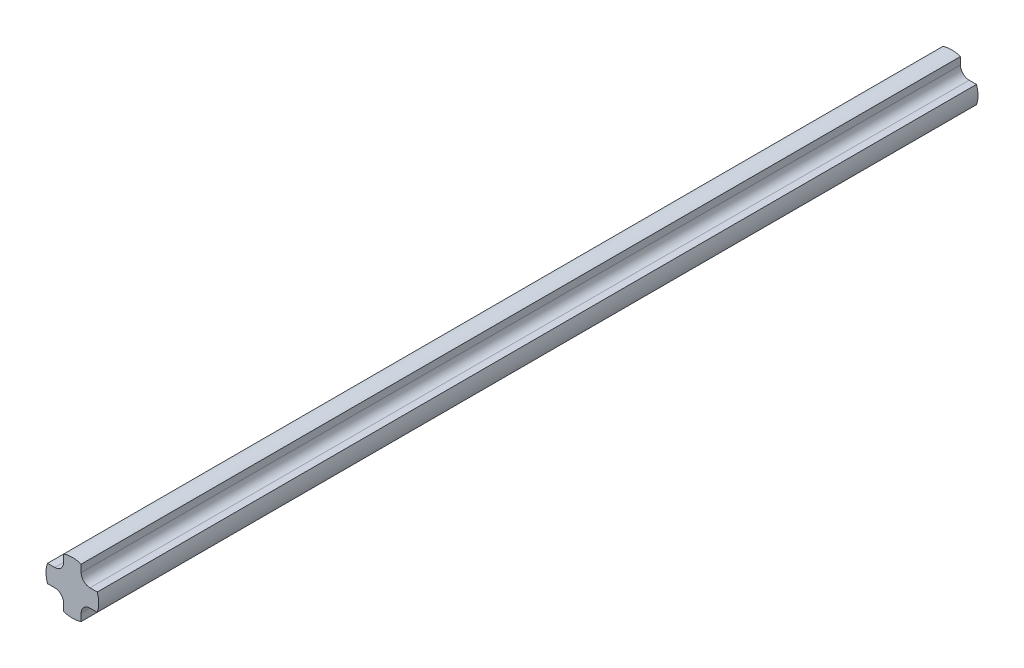
ISO-10303-21;
HEADER;
FILE_DESCRIPTION(('STEP AP214'),'2;1');
FILE_NAME('part.step','',(''),(''),'','','');
FILE_SCHEMA(('AUTOMOTIVE_DESIGN { 1 0 10303 214 1 1 1 1 }'));
ENDSEC;
DATA;
#1=APPLICATION_CONTEXT('core data for automotive mechanical design processes');
#2=APPLICATION_PROTOCOL_DEFINITION('international standard','automotive_design',2000,#1);
#3=PRODUCT_CONTEXT('',#1,'mechanical');
#4=PRODUCT('Part','Part','',(#3));
#5=PRODUCT_RELATED_PRODUCT_CATEGORY('part','',(#4));
#6=PRODUCT_DEFINITION_FORMATION('','',#4);
#7=PRODUCT_DEFINITION_CONTEXT('part definition',#1,'design');
#8=PRODUCT_DEFINITION('design','',#6,#7);
#9=PRODUCT_DEFINITION_SHAPE('','',#8);
#10=(LENGTH_UNIT() NAMED_UNIT(*) SI_UNIT(.MILLI.,.METRE.));
#11=(NAMED_UNIT(*) PLANE_ANGLE_UNIT() SI_UNIT($,.RADIAN.));
#12=(NAMED_UNIT(*) SI_UNIT($,.STERADIAN.) SOLID_ANGLE_UNIT());
#13=UNCERTAINTY_MEASURE_WITH_UNIT(LENGTH_MEASURE(1.E-05),#10,'distance_accuracy_value','');
#14=(GEOMETRIC_REPRESENTATION_CONTEXT(3) GLOBAL_UNCERTAINTY_ASSIGNED_CONTEXT((#13)) GLOBAL_UNIT_ASSIGNED_CONTEXT((#10,
#11,#12)) REPRESENTATION_CONTEXT('',''));
#15=CARTESIAN_POINT('',(0.,0.,0.));
#16=DIRECTION('',(0.,0.,1.));
#17=DIRECTION('',(1.,0.,0.));
#18=AXIS2_PLACEMENT_3D('',#15,#16,#17);
#19=CARTESIAN_POINT('',(-141.42135623731,-50.,5000.));
#20=DIRECTION('',(0.,1.,0.));
#21=DIRECTION('',(0.,0.,1.));
#22=AXIS2_PLACEMENT_3D('',#19,#20,#21);
#23=PLANE('',#22);
#24=DIRECTION('',(1.,0.,0.));
#25=VECTOR('',#24,1.);
#26=CARTESIAN_POINT('',(-141.42135623731,-50.,0.));
#27=LINE('',#26,#25);
#28=CARTESIAN_POINT('',(-141.42135623731,-50.,0.));
#29=VERTEX_POINT('',#28);
#30=CARTESIAN_POINT('',(-99.9999999999996,-50.,0.));
#31=VERTEX_POINT('',#30);
#32=EDGE_CURVE('E245',#29,#31,#27,.T.);
#33=ORIENTED_EDGE('',*,*,#32,.T.);
#34=DIRECTION('',(0.,0.,-1.));
#35=VECTOR('',#34,1.);
#36=CARTESIAN_POINT('',(-99.9999999999996,-50.,5000.));
#37=LINE('',#36,#35);
#38=CARTESIAN_POINT('',(-99.9999999999996,-50.,5000.));
#39=VERTEX_POINT('',#38);
#40=EDGE_CURVE('E64',#31,#39,#37,.F.);
#41=ORIENTED_EDGE('',*,*,#40,.T.);
#42=DIRECTION('',(1.,0.,0.));
#43=VECTOR('',#42,1.);
#44=CARTESIAN_POINT('',(-141.42135623731,-50.,5000.));
#45=LINE('',#44,#43);
#46=CARTESIAN_POINT('',(-141.42135623731,-50.,5000.));
#47=VERTEX_POINT('',#46);
#48=EDGE_CURVE('E237',#47,#39,#45,.T.);
#49=ORIENTED_EDGE('',*,*,#48,.F.);
#50=DIRECTION('',(0.,0.,-1.));
#51=VECTOR('',#50,1.);
#52=CARTESIAN_POINT('',(-141.42135623731,-50.,5000.));
#53=LINE('',#52,#51);
#54=EDGE_CURVE('E251',#47,#29,#53,.T.);
#55=ORIENTED_EDGE('',*,*,#54,.T.);
#56=EDGE_LOOP('',(#33,#41,#49,#55));
#57=FACE_BOUND('',#56,.T.);
#58=ADVANCED_FACE('F43',(#57),#23,.F.);
#59=CARTESIAN_POINT('',(-141.421356237309,50.,5000.));
#60=DIRECTION('',(0.,-1.,0.));
#61=DIRECTION('',(0.,0.,-1.));
#62=AXIS2_PLACEMENT_3D('',#59,#60,#61);
#63=PLANE('',#62);
#64=DIRECTION('',(-1.,0.,0.));
#65=VECTOR('',#64,1.);
#66=CARTESIAN_POINT('',(-141.421356237309,50.,5000.));
#67=LINE('',#66,#65);
#68=CARTESIAN_POINT('',(-100.,50.,5000.));
#69=VERTEX_POINT('',#68);
#70=CARTESIAN_POINT('',(-141.421356237309,50.,5000.));
#71=VERTEX_POINT('',#70);
#72=EDGE_CURVE('E240',#69,#71,#67,.T.);
#73=ORIENTED_EDGE('',*,*,#72,.F.);
#74=DIRECTION('',(0.,0.,1.));
#75=VECTOR('',#74,1.);
#76=CARTESIAN_POINT('',(-100.,50.,0.));
#77=LINE('',#76,#75);
#78=CARTESIAN_POINT('',(-100.,50.,0.));
#79=VERTEX_POINT('',#78);
#80=EDGE_CURVE('E267',#69,#79,#77,.F.);
#81=ORIENTED_EDGE('',*,*,#80,.T.);
#82=DIRECTION('',(-1.,0.,0.));
#83=VECTOR('',#82,1.);
#84=CARTESIAN_POINT('',(-141.421356237309,50.,0.));
#85=LINE('',#84,#83);
#86=CARTESIAN_POINT('',(-141.421356237309,50.,0.));
#87=VERTEX_POINT('',#86);
#88=EDGE_CURVE('E238',#79,#87,#85,.T.);
#89=ORIENTED_EDGE('',*,*,#88,.T.);
#90=DIRECTION('',(0.,0.,-1.));
#91=VECTOR('',#90,1.);
#92=CARTESIAN_POINT('',(-141.421356237309,50.,5000.));
#93=LINE('',#92,#91);
#94=EDGE_CURVE('E242',#71,#87,#93,.T.);
#95=ORIENTED_EDGE('',*,*,#94,.F.);
#96=EDGE_LOOP('',(#73,#81,#89,#95));
#97=FACE_BOUND('',#96,.T.);
#98=ADVANCED_FACE('F297',(#97),#63,.F.);
#99=CARTESIAN_POINT('',(0.,0.,5000.));
#100=DIRECTION('',(0.,0.,-1.));
#101=DIRECTION('',(-1.,0.,0.));
#102=AXIS2_PLACEMENT_3D('',#99,#100,#101);
#103=CYLINDRICAL_SURFACE('',#102,150.);
#104=CARTESIAN_POINT('',(0.,0.,0.));
#105=DIRECTION('',(0.,0.,1.));
#106=DIRECTION('',(1.,0.,0.));
#107=AXIS2_PLACEMENT_3D('',#104,#105,#106);
#108=CIRCLE('',#107,150.);
#109=EDGE_CURVE('E233',#87,#29,#108,.T.);
#110=ORIENTED_EDGE('',*,*,#109,.T.);
#111=ORIENTED_EDGE('',*,*,#54,.F.);
#112=CARTESIAN_POINT('',(0.,0.,5000.));
#113=DIRECTION('',(0.,0.,1.));
#114=DIRECTION('',(1.,0.,0.));
#115=AXIS2_PLACEMENT_3D('',#112,#113,#114);
#116=CIRCLE('',#115,150.);
#117=EDGE_CURVE('E234',#71,#47,#116,.T.);
#118=ORIENTED_EDGE('',*,*,#117,.F.);
#119=ORIENTED_EDGE('',*,*,#94,.T.);
#120=EDGE_LOOP('',(#110,#111,#118,#119));
#121=FACE_BOUND('',#120,.T.);
#122=ADVANCED_FACE('F301',(#121),#103,.T.);
#123=CARTESIAN_POINT('',(0.,0.,5000.));
#124=DIRECTION('',(0.,0.,1.));
#125=DIRECTION('',(1.,0.,0.));
#126=AXIS2_PLACEMENT_3D('',#123,#124,#125);
#127=PLANE('',#126);
#128=DIRECTION('',(0.,-1.,0.));
#129=VECTOR('',#128,1.);
#130=CARTESIAN_POINT('',(-49.9999999999995,-141.42135623731,5000.));
#131=LINE('',#130,#129);
#132=CARTESIAN_POINT('',(-50.0000000000015,141.421356237309,5000.));
#133=VERTEX_POINT('',#132);
#134=CARTESIAN_POINT('',(-50.0000000000003,100.,5000.));
#135=VERTEX_POINT('',#134);
#136=EDGE_CURVE('E155',#133,#135,#131,.T.);
#137=ORIENTED_EDGE('',*,*,#136,.T.);
#138=CARTESIAN_POINT('',(-100.,100.,5000.));
#139=DIRECTION('',(0.,0.,1.));
#140=DIRECTION('',(1.,0.,0.));
#141=AXIS2_PLACEMENT_3D('',#138,#139,#140);
#142=CIRCLE('',#141,50.);
#143=EDGE_CURVE('E284',#135,#69,#142,.F.);
#144=ORIENTED_EDGE('',*,*,#143,.T.);
#145=ORIENTED_EDGE('',*,*,#72,.T.);
#146=ORIENTED_EDGE('',*,*,#117,.T.);
#147=ORIENTED_EDGE('',*,*,#48,.T.);
#148=CARTESIAN_POINT('',(-99.9999999999996,-100.,5000.));
#149=DIRECTION('',(0.,0.,1.));
#150=DIRECTION('',(1.,0.,0.));
#151=AXIS2_PLACEMENT_3D('',#148,#149,#150);
#152=CIRCLE('',#151,50.);
#153=CARTESIAN_POINT('',(-49.9999999999997,-99.9999999999998,5000.));
#154=VERTEX_POINT('',#153);
#155=EDGE_CURVE('E11',#39,#154,#152,.F.);
#156=ORIENTED_EDGE('',*,*,#155,.T.);
#157=CARTESIAN_POINT('',(-49.9999999999995,-141.42135623731,5000.));
#158=VERTEX_POINT('',#157);
#159=EDGE_CURVE('E166',#154,#158,#131,.T.);
#160=ORIENTED_EDGE('',*,*,#159,.T.);
#161=CARTESIAN_POINT('',(0.,0.,5000.));
#162=DIRECTION('',(0.,0.,1.));
#163=DIRECTION('',(0.,1.,0.));
#164=AXIS2_PLACEMENT_3D('',#161,#162,#163);
#165=CIRCLE('',#164,150.);
#166=CARTESIAN_POINT('',(50.0000000000005,-141.421356237309,5000.));
#167=VERTEX_POINT('',#166);
#168=EDGE_CURVE('E213',#158,#167,#165,.T.);
#169=ORIENTED_EDGE('',*,*,#168,.T.);
#170=DIRECTION('',(0.,1.,0.));
#171=VECTOR('',#170,1.);
#172=CARTESIAN_POINT('',(50.0000000000005,-141.421356237309,5000.));
#173=LINE('',#172,#171);
#174=CARTESIAN_POINT('',(50.0000000000003,-100.,5000.));
#175=VERTEX_POINT('',#174);
#176=EDGE_CURVE('E216',#167,#175,#173,.T.);
#177=ORIENTED_EDGE('',*,*,#176,.T.);
#178=CARTESIAN_POINT('',(100.,-100.,5000.));
#179=DIRECTION('',(0.,0.,1.));
#180=DIRECTION('',(1.,0.,0.));
#181=AXIS2_PLACEMENT_3D('',#178,#179,#180);
#182=CIRCLE('',#181,50.);
#183=CARTESIAN_POINT('',(100.,-50.,5000.));
#184=VERTEX_POINT('',#183);
#185=EDGE_CURVE('E282',#175,#184,#182,.F.);
#186=ORIENTED_EDGE('',*,*,#185,.T.);
#187=DIRECTION('',(1.,0.,0.));
#188=VECTOR('',#187,1.);
#189=CARTESIAN_POINT('',(141.421356237309,-50.,5000.));
#190=LINE('',#189,#188);
#191=CARTESIAN_POINT('',(141.421356237309,-50.,5000.));
#192=VERTEX_POINT('',#191);
#193=EDGE_CURVE('E201',#184,#192,#190,.T.);
#194=ORIENTED_EDGE('',*,*,#193,.T.);
#195=CARTESIAN_POINT('',(0.,0.,5000.));
#196=DIRECTION('',(0.,0.,1.));
#197=DIRECTION('',(-1.,0.,0.));
#198=AXIS2_PLACEMENT_3D('',#195,#196,#197);
#199=CIRCLE('',#198,150.);
#200=CARTESIAN_POINT('',(141.42135623731,50.,5000.));
#201=VERTEX_POINT('',#200);
#202=EDGE_CURVE('E194',#192,#201,#199,.T.);
#203=ORIENTED_EDGE('',*,*,#202,.T.);
#204=DIRECTION('',(-1.,0.,0.));
#205=VECTOR('',#204,1.);
#206=CARTESIAN_POINT('',(141.42135623731,50.,5000.));
#207=LINE('',#206,#205);
#208=CARTESIAN_POINT('',(99.9999999999989,50.,5000.));
#209=VERTEX_POINT('',#208);
#210=EDGE_CURVE('E197',#201,#209,#207,.T.);
#211=ORIENTED_EDGE('',*,*,#210,.T.);
#212=CARTESIAN_POINT('',(99.9999999999989,100.,5000.));
#213=DIRECTION('',(0.,0.,1.));
#214=DIRECTION('',(1.,0.,0.));
#215=AXIS2_PLACEMENT_3D('',#212,#213,#214);
#216=CIRCLE('',#215,50.);
#217=CARTESIAN_POINT('',(49.999999999999,99.9999999999995,5000.));
#218=VERTEX_POINT('',#217);
#219=EDGE_CURVE('E278',#209,#218,#216,.F.);
#220=ORIENTED_EDGE('',*,*,#219,.T.);
#221=DIRECTION('',(0.,1.,0.));
#222=VECTOR('',#221,1.);
#223=CARTESIAN_POINT('',(49.9999999999985,141.42135623731,5000.));
#224=LINE('',#223,#222);
#225=CARTESIAN_POINT('',(49.9999999999985,141.42135623731,5000.));
#226=VERTEX_POINT('',#225);
#227=EDGE_CURVE('E172',#218,#226,#224,.T.);
#228=ORIENTED_EDGE('',*,*,#227,.T.);
#229=CARTESIAN_POINT('',(0.,0.,5000.));
#230=DIRECTION('',(0.,0.,1.));
#231=DIRECTION('',(0.,-1.,0.));
#232=AXIS2_PLACEMENT_3D('',#229,#230,#231);
#233=CIRCLE('',#232,150.);
#234=EDGE_CURVE('E169',#226,#133,#233,.T.);
#235=ORIENTED_EDGE('',*,*,#234,.T.);
#236=EDGE_LOOP('',(#137,#144,#145,#146,#147,#156,#160,#169,#177,#186,#194,#203,#211,#220,#228,#235));
#237=FACE_BOUND('',#236,.T.);
#238=ADVANCED_FACE('F170',(#237),#127,.T.);
#239=CARTESIAN_POINT('',(0.,0.,0.));
#240=DIRECTION('',(0.,0.,1.));
#241=DIRECTION('',(1.,0.,0.));
#242=AXIS2_PLACEMENT_3D('',#239,#240,#241);
#243=PLANE('',#242);
#244=ORIENTED_EDGE('',*,*,#88,.F.);
#245=CARTESIAN_POINT('',(-100.,100.,0.));
#246=DIRECTION('',(0.,0.,1.));
#247=DIRECTION('',(1.,0.,0.));
#248=AXIS2_PLACEMENT_3D('',#245,#246,#247);
#249=CIRCLE('',#248,50.);
#250=CARTESIAN_POINT('',(-50.0000000000003,100.,0.));
#251=VERTEX_POINT('',#250);
#252=EDGE_CURVE('E286',#79,#251,#249,.T.);
#253=ORIENTED_EDGE('',*,*,#252,.T.);
#254=DIRECTION('',(0.,-1.,0.));
#255=VECTOR('',#254,1.);
#256=CARTESIAN_POINT('',(-49.9999999999995,-141.42135623731,0.));
#257=LINE('',#256,#255);
#258=CARTESIAN_POINT('',(-50.0000000000015,141.421356237309,0.));
#259=VERTEX_POINT('',#258);
#260=EDGE_CURVE('E217',#259,#251,#257,.T.);
#261=ORIENTED_EDGE('',*,*,#260,.F.);
#262=CARTESIAN_POINT('',(0.,0.,0.));
#263=DIRECTION('',(0.,0.,1.));
#264=DIRECTION('',(0.,-1.,0.));
#265=AXIS2_PLACEMENT_3D('',#262,#263,#264);
#266=CIRCLE('',#265,150.);
#267=CARTESIAN_POINT('',(49.9999999999985,141.42135623731,0.));
#268=VERTEX_POINT('',#267);
#269=EDGE_CURVE('E180',#268,#259,#266,.T.);
#270=ORIENTED_EDGE('',*,*,#269,.F.);
#271=DIRECTION('',(0.,1.,0.));
#272=VECTOR('',#271,1.);
#273=CARTESIAN_POINT('',(49.9999999999985,141.42135623731,0.));
#274=LINE('',#273,#272);
#275=CARTESIAN_POINT('',(49.999999999999,99.9999999999995,0.));
#276=VERTEX_POINT('',#275);
#277=EDGE_CURVE('E176',#276,#268,#274,.T.);
#278=ORIENTED_EDGE('',*,*,#277,.F.);
#279=CARTESIAN_POINT('',(99.9999999999989,100.,0.));
#280=DIRECTION('',(0.,0.,1.));
#281=DIRECTION('',(1.,0.,0.));
#282=AXIS2_PLACEMENT_3D('',#279,#280,#281);
#283=CIRCLE('',#282,50.);
#284=CARTESIAN_POINT('',(99.9999999999989,50.,0.));
#285=VERTEX_POINT('',#284);
#286=EDGE_CURVE('E276',#276,#285,#283,.T.);
#287=ORIENTED_EDGE('',*,*,#286,.T.);
#288=DIRECTION('',(-1.,0.,0.));
#289=VECTOR('',#288,1.);
#290=CARTESIAN_POINT('',(141.42135623731,50.,0.));
#291=LINE('',#290,#289);
#292=CARTESIAN_POINT('',(141.42135623731,50.,0.));
#293=VERTEX_POINT('',#292);
#294=EDGE_CURVE('E188',#293,#285,#291,.T.);
#295=ORIENTED_EDGE('',*,*,#294,.F.);
#296=CARTESIAN_POINT('',(0.,0.,0.));
#297=DIRECTION('',(0.,0.,1.));
#298=DIRECTION('',(-1.,0.,0.));
#299=AXIS2_PLACEMENT_3D('',#296,#297,#298);
#300=CIRCLE('',#299,150.);
#301=CARTESIAN_POINT('',(141.421356237309,-50.,0.));
#302=VERTEX_POINT('',#301);
#303=EDGE_CURVE('E182',#302,#293,#300,.T.);
#304=ORIENTED_EDGE('',*,*,#303,.F.);
#305=DIRECTION('',(1.,0.,0.));
#306=VECTOR('',#305,1.);
#307=CARTESIAN_POINT('',(141.421356237309,-50.,0.));
#308=LINE('',#307,#306);
#309=CARTESIAN_POINT('',(100.,-50.,0.));
#310=VERTEX_POINT('',#309);
#311=EDGE_CURVE('E198',#310,#302,#308,.T.);
#312=ORIENTED_EDGE('',*,*,#311,.F.);
#313=CARTESIAN_POINT('',(100.,-100.,0.));
#314=DIRECTION('',(0.,0.,1.));
#315=DIRECTION('',(1.,0.,0.));
#316=AXIS2_PLACEMENT_3D('',#313,#314,#315);
#317=CIRCLE('',#316,50.);
#318=CARTESIAN_POINT('',(50.0000000000003,-100.,0.));
#319=VERTEX_POINT('',#318);
#320=EDGE_CURVE('E280',#310,#319,#317,.T.);
#321=ORIENTED_EDGE('',*,*,#320,.T.);
#322=DIRECTION('',(0.,1.,0.));
#323=VECTOR('',#322,1.);
#324=CARTESIAN_POINT('',(50.0000000000005,-141.421356237309,0.));
#325=LINE('',#324,#323);
#326=CARTESIAN_POINT('',(50.0000000000005,-141.421356237309,0.));
#327=VERTEX_POINT('',#326);
#328=EDGE_CURVE('E222',#327,#319,#325,.T.);
#329=ORIENTED_EDGE('',*,*,#328,.F.);
#330=CARTESIAN_POINT('',(0.,0.,0.));
#331=DIRECTION('',(0.,0.,1.));
#332=DIRECTION('',(0.,1.,0.));
#333=AXIS2_PLACEMENT_3D('',#330,#331,#332);
#334=CIRCLE('',#333,150.);
#335=CARTESIAN_POINT('',(-49.9999999999995,-141.42135623731,0.));
#336=VERTEX_POINT('',#335);
#337=EDGE_CURVE('E212',#336,#327,#334,.T.);
#338=ORIENTED_EDGE('',*,*,#337,.F.);
#339=CARTESIAN_POINT('',(-49.9999999999997,-99.9999999999998,0.));
#340=VERTEX_POINT('',#339);
#341=EDGE_CURVE('E225',#340,#336,#257,.T.);
#342=ORIENTED_EDGE('',*,*,#341,.F.);
#343=CARTESIAN_POINT('',(-99.9999999999996,-100.,0.));
#344=DIRECTION('',(0.,0.,1.));
#345=DIRECTION('',(1.,0.,0.));
#346=AXIS2_PLACEMENT_3D('',#343,#344,#345);
#347=CIRCLE('',#346,50.);
#348=EDGE_CURVE('E51',#340,#31,#347,.T.);
#349=ORIENTED_EDGE('',*,*,#348,.T.);
#350=ORIENTED_EDGE('',*,*,#32,.F.);
#351=ORIENTED_EDGE('',*,*,#109,.F.);
#352=EDGE_LOOP('',(#244,#253,#261,#270,#278,#287,#295,#304,#312,#321,#329,#338,#342,#349,#350,#351));
#353=FACE_BOUND('',#352,.T.);
#354=ADVANCED_FACE('F289',(#353),#243,.F.);
#355=CARTESIAN_POINT('',(-49.9999999999995,-141.42135623731,5000.));
#356=DIRECTION('',(1.,0.,0.));
#357=DIRECTION('',(0.,0.,-1.));
#358=AXIS2_PLACEMENT_3D('',#355,#356,#357);
#359=PLANE('',#358);
#360=ORIENTED_EDGE('',*,*,#159,.F.);
#361=DIRECTION('',(0.,0.,-1.));
#362=VECTOR('',#361,1.);
#363=CARTESIAN_POINT('',(-49.9999999999997,-99.9999999999998,0.));
#364=LINE('',#363,#362);
#365=EDGE_CURVE('E270',#154,#340,#364,.T.);
#366=ORIENTED_EDGE('',*,*,#365,.T.);
#367=ORIENTED_EDGE('',*,*,#341,.T.);
#368=DIRECTION('',(0.,0.,-1.));
#369=VECTOR('',#368,1.);
#370=CARTESIAN_POINT('',(-49.9999999999995,-141.42135623731,5000.));
#371=LINE('',#370,#369);
#372=EDGE_CURVE('E165',#158,#336,#371,.T.);
#373=ORIENTED_EDGE('',*,*,#372,.F.);
#374=EDGE_LOOP('',(#360,#366,#367,#373));
#375=FACE_BOUND('',#374,.T.);
#376=ADVANCED_FACE('F307',(#375),#359,.F.);
#377=ORIENTED_EDGE('',*,*,#260,.T.);
#378=DIRECTION('',(0.,0.,1.));
#379=VECTOR('',#378,1.);
#380=CARTESIAN_POINT('',(-50.0000000000003,100.,5000.));
#381=LINE('',#380,#379);
#382=EDGE_CURVE('E163',#251,#135,#381,.T.);
#383=ORIENTED_EDGE('',*,*,#382,.T.);
#384=ORIENTED_EDGE('',*,*,#136,.F.);
#385=DIRECTION('',(0.,0.,-1.));
#386=VECTOR('',#385,1.);
#387=CARTESIAN_POINT('',(-50.0000000000015,141.421356237309,5000.));
#388=LINE('',#387,#386);
#389=EDGE_CURVE('E160',#133,#259,#388,.T.);
#390=ORIENTED_EDGE('',*,*,#389,.T.);
#391=EDGE_LOOP('',(#377,#383,#384,#390));
#392=FACE_BOUND('',#391,.T.);
#393=ADVANCED_FACE('F158',(#392),#359,.F.);
#394=CARTESIAN_POINT('',(50.0000000000005,-141.421356237309,5000.));
#395=DIRECTION('',(-1.,0.,0.));
#396=DIRECTION('',(0.,0.,1.));
#397=AXIS2_PLACEMENT_3D('',#394,#395,#396);
#398=PLANE('',#397);
#399=ORIENTED_EDGE('',*,*,#328,.T.);
#400=DIRECTION('',(0.,0.,-1.));
#401=VECTOR('',#400,1.);
#402=CARTESIAN_POINT('',(50.0000000000003,-100.,5000.));
#403=LINE('',#402,#401);
#404=EDGE_CURVE('E263',#319,#175,#403,.F.);
#405=ORIENTED_EDGE('',*,*,#404,.T.);
#406=ORIENTED_EDGE('',*,*,#176,.F.);
#407=DIRECTION('',(0.,0.,-1.));
#408=VECTOR('',#407,1.);
#409=CARTESIAN_POINT('',(50.0000000000005,-141.421356237309,5000.));
#410=LINE('',#409,#408);
#411=EDGE_CURVE('E230',#167,#327,#410,.T.);
#412=ORIENTED_EDGE('',*,*,#411,.T.);
#413=EDGE_LOOP('',(#399,#405,#406,#412));
#414=FACE_BOUND('',#413,.T.);
#415=ADVANCED_FACE('F424',(#414),#398,.F.);
#416=CARTESIAN_POINT('',(0.,0.,5000.));
#417=DIRECTION('',(0.,0.,-1.));
#418=DIRECTION('',(0.,-1.,0.));
#419=AXIS2_PLACEMENT_3D('',#416,#417,#418);
#420=CYLINDRICAL_SURFACE('',#419,150.);
#421=ORIENTED_EDGE('',*,*,#337,.T.);
#422=ORIENTED_EDGE('',*,*,#411,.F.);
#423=ORIENTED_EDGE('',*,*,#168,.F.);
#424=ORIENTED_EDGE('',*,*,#372,.T.);
#425=EDGE_LOOP('',(#421,#422,#423,#424));
#426=FACE_BOUND('',#425,.T.);
#427=ADVANCED_FACE('F312',(#426),#420,.T.);
#428=CARTESIAN_POINT('',(141.421356237309,-50.,5000.));
#429=DIRECTION('',(0.,1.,0.));
#430=DIRECTION('',(0.,0.,-1.));
#431=AXIS2_PLACEMENT_3D('',#428,#429,#430);
#432=PLANE('',#431);
#433=ORIENTED_EDGE('',*,*,#193,.F.);
#434=DIRECTION('',(0.,0.,-1.));
#435=VECTOR('',#434,1.);
#436=CARTESIAN_POINT('',(100.,-50.,0.));
#437=LINE('',#436,#435);
#438=EDGE_CURVE('E260',#184,#310,#437,.T.);
#439=ORIENTED_EDGE('',*,*,#438,.T.);
#440=ORIENTED_EDGE('',*,*,#311,.T.);
#441=DIRECTION('',(0.,0.,-1.));
#442=VECTOR('',#441,1.);
#443=CARTESIAN_POINT('',(141.421356237309,-50.,5000.));
#444=LINE('',#443,#442);
#445=EDGE_CURVE('E202',#192,#302,#444,.T.);
#446=ORIENTED_EDGE('',*,*,#445,.F.);
#447=EDGE_LOOP('',(#433,#439,#440,#446));
#448=FACE_BOUND('',#447,.T.);
#449=ADVANCED_FACE('F323',(#448),#432,.F.);
#450=CARTESIAN_POINT('',(141.42135623731,50.,5000.));
#451=DIRECTION('',(0.,-1.,0.));
#452=DIRECTION('',(0.,0.,1.));
#453=AXIS2_PLACEMENT_3D('',#450,#451,#452);
#454=PLANE('',#453);
#455=ORIENTED_EDGE('',*,*,#294,.T.);
#456=DIRECTION('',(0.,0.,-1.));
#457=VECTOR('',#456,1.);
#458=CARTESIAN_POINT('',(99.9999999999989,50.,5000.));
#459=LINE('',#458,#457);
#460=EDGE_CURVE('E258',#285,#209,#459,.F.);
#461=ORIENTED_EDGE('',*,*,#460,.T.);
#462=ORIENTED_EDGE('',*,*,#210,.F.);
#463=DIRECTION('',(0.,0.,-1.));
#464=VECTOR('',#463,1.);
#465=CARTESIAN_POINT('',(141.42135623731,50.,5000.));
#466=LINE('',#465,#464);
#467=EDGE_CURVE('E209',#201,#293,#466,.T.);
#468=ORIENTED_EDGE('',*,*,#467,.T.);
#469=EDGE_LOOP('',(#455,#461,#462,#468));
#470=FACE_BOUND('',#469,.T.);
#471=ADVANCED_FACE('F341',(#470),#454,.F.);
#472=CARTESIAN_POINT('',(0.,0.,5000.));
#473=DIRECTION('',(0.,0.,-1.));
#474=DIRECTION('',(1.,0.,0.));
#475=AXIS2_PLACEMENT_3D('',#472,#473,#474);
#476=CYLINDRICAL_SURFACE('',#475,150.);
#477=ORIENTED_EDGE('',*,*,#303,.T.);
#478=ORIENTED_EDGE('',*,*,#467,.F.);
#479=ORIENTED_EDGE('',*,*,#202,.F.);
#480=ORIENTED_EDGE('',*,*,#445,.T.);
#481=EDGE_LOOP('',(#477,#478,#479,#480));
#482=FACE_BOUND('',#481,.T.);
#483=ADVANCED_FACE('F328',(#482),#476,.T.);
#484=CARTESIAN_POINT('',(49.9999999999985,141.42135623731,5000.));
#485=DIRECTION('',(-1.,0.,0.));
#486=DIRECTION('',(0.,0.,-1.));
#487=AXIS2_PLACEMENT_3D('',#484,#485,#486);
#488=PLANE('',#487);
#489=ORIENTED_EDGE('',*,*,#227,.F.);
#490=DIRECTION('',(0.,0.,-1.));
#491=VECTOR('',#490,1.);
#492=CARTESIAN_POINT('',(49.999999999999,99.9999999999995,0.));
#493=LINE('',#492,#491);
#494=EDGE_CURVE('E255',#218,#276,#493,.T.);
#495=ORIENTED_EDGE('',*,*,#494,.T.);
#496=ORIENTED_EDGE('',*,*,#277,.T.);
#497=DIRECTION('',(0.,0.,-1.));
#498=VECTOR('',#497,1.);
#499=CARTESIAN_POINT('',(49.9999999999985,141.42135623731,5000.));
#500=LINE('',#499,#498);
#501=EDGE_CURVE('E183',#226,#268,#500,.T.);
#502=ORIENTED_EDGE('',*,*,#501,.F.);
#503=EDGE_LOOP('',(#489,#495,#496,#502));
#504=FACE_BOUND('',#503,.T.);
#505=ADVANCED_FACE('F338',(#504),#488,.F.);
#506=CARTESIAN_POINT('',(0.,0.,5000.));
#507=DIRECTION('',(0.,0.,-1.));
#508=DIRECTION('',(0.,1.,0.));
#509=AXIS2_PLACEMENT_3D('',#506,#507,#508);
#510=CYLINDRICAL_SURFACE('',#509,150.);
#511=ORIENTED_EDGE('',*,*,#269,.T.);
#512=ORIENTED_EDGE('',*,*,#389,.F.);
#513=ORIENTED_EDGE('',*,*,#234,.F.);
#514=ORIENTED_EDGE('',*,*,#501,.T.);
#515=EDGE_LOOP('',(#511,#512,#513,#514));
#516=FACE_BOUND('',#515,.T.);
#517=ADVANCED_FACE('F178',(#516),#510,.T.);
#518=CARTESIAN_POINT('',(99.9999999999989,100.,5000.));
#519=DIRECTION('',(0.,0.,1.));
#520=DIRECTION('',(1.,0.,0.));
#521=AXIS2_PLACEMENT_3D('',#518,#519,#520);
#522=CYLINDRICAL_SURFACE('',#521,50.);
#523=ORIENTED_EDGE('',*,*,#219,.F.);
#524=ORIENTED_EDGE('',*,*,#460,.F.);
#525=ORIENTED_EDGE('',*,*,#286,.F.);
#526=ORIENTED_EDGE('',*,*,#494,.F.);
#527=EDGE_LOOP('',(#523,#524,#525,#526));
#528=FACE_BOUND('',#527,.T.);
#529=ADVANCED_FACE('F335',(#528),#522,.F.);
#530=CARTESIAN_POINT('',(100.,-100.,5000.));
#531=DIRECTION('',(0.,0.,1.));
#532=DIRECTION('',(1.,0.,0.));
#533=AXIS2_PLACEMENT_3D('',#530,#531,#532);
#534=CYLINDRICAL_SURFACE('',#533,50.);
#535=ORIENTED_EDGE('',*,*,#185,.F.);
#536=ORIENTED_EDGE('',*,*,#404,.F.);
#537=ORIENTED_EDGE('',*,*,#320,.F.);
#538=ORIENTED_EDGE('',*,*,#438,.F.);
#539=EDGE_LOOP('',(#535,#536,#537,#538));
#540=FACE_BOUND('',#539,.T.);
#541=ADVANCED_FACE('F320',(#540),#534,.F.);
#542=CARTESIAN_POINT('',(-100.,100.,5000.));
#543=DIRECTION('',(0.,0.,-1.));
#544=DIRECTION('',(-1.,0.,0.));
#545=AXIS2_PLACEMENT_3D('',#542,#543,#544);
#546=CYLINDRICAL_SURFACE('',#545,50.);
#547=ORIENTED_EDGE('',*,*,#252,.F.);
#548=ORIENTED_EDGE('',*,*,#80,.F.);
#549=ORIENTED_EDGE('',*,*,#143,.F.);
#550=ORIENTED_EDGE('',*,*,#382,.F.);
#551=EDGE_LOOP('',(#547,#548,#549,#550));
#552=FACE_BOUND('',#551,.T.);
#553=ADVANCED_FACE('F293',(#552),#546,.F.);
#554=CARTESIAN_POINT('',(-99.9999999999996,-100.,5000.));
#555=DIRECTION('',(0.,0.,1.));
#556=DIRECTION('',(1.,0.,0.));
#557=AXIS2_PLACEMENT_3D('',#554,#555,#556);
#558=CYLINDRICAL_SURFACE('',#557,50.);
#559=ORIENTED_EDGE('',*,*,#155,.F.);
#560=ORIENTED_EDGE('',*,*,#40,.F.);
#561=ORIENTED_EDGE('',*,*,#348,.F.);
#562=ORIENTED_EDGE('',*,*,#365,.F.);
#563=EDGE_LOOP('',(#559,#560,#561,#562));
#564=FACE_BOUND('',#563,.T.);
#565=ADVANCED_FACE('F45',(#564),#558,.F.);
#566=CLOSED_SHELL('',(#58,#98,#122,#238,#354,#376,#393,#415,#427,#449,#471,#483,#505,#517,#529,
#541,#553,#565));
#567=MANIFOLD_SOLID_BREP('B2',#566);
#568=ADVANCED_BREP_SHAPE_REPRESENTATION('',(#18,#567),#14);
#569=SHAPE_DEFINITION_REPRESENTATION(#9,#568);
ENDSEC;
END-ISO-10303-21;
